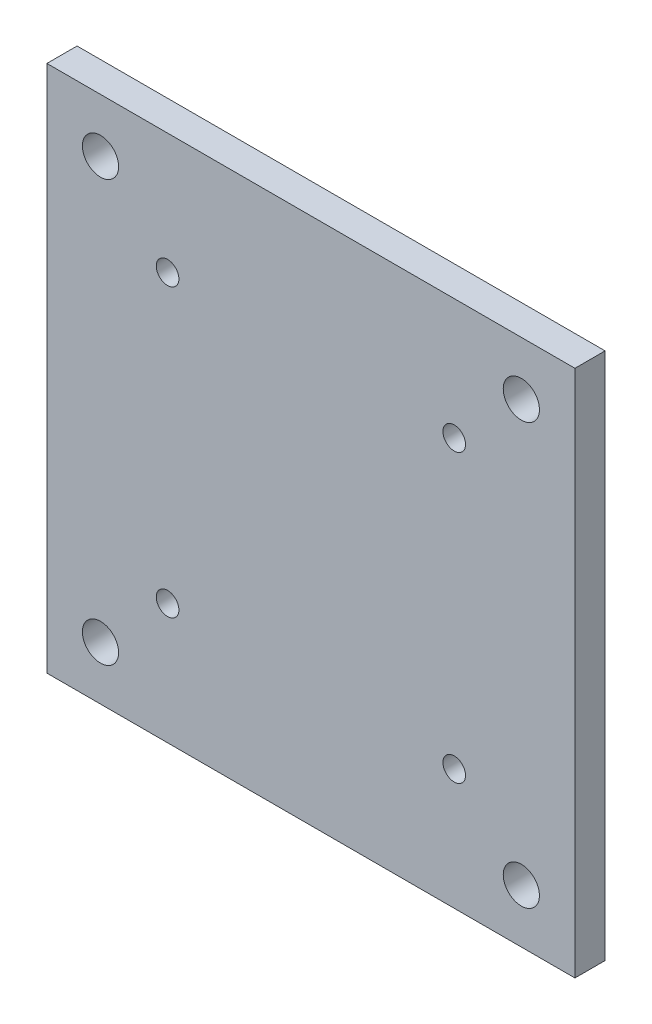
ISO-10303-21;
HEADER;
FILE_DESCRIPTION(('STEP AP214'),'2;1');
FILE_NAME('part.step','',(''),(''),'','','');
FILE_SCHEMA(('AUTOMOTIVE_DESIGN { 1 0 10303 214 1 1 1 1 }'));
ENDSEC;
DATA;
#1=APPLICATION_CONTEXT('core data for automotive mechanical design processes');
#2=APPLICATION_PROTOCOL_DEFINITION('international standard','automotive_design',2000,#1);
#3=PRODUCT_CONTEXT('',#1,'mechanical');
#4=PRODUCT('Part','Part','',(#3));
#5=PRODUCT_RELATED_PRODUCT_CATEGORY('part','',(#4));
#6=PRODUCT_DEFINITION_FORMATION('','',#4);
#7=PRODUCT_DEFINITION_CONTEXT('part definition',#1,'design');
#8=PRODUCT_DEFINITION('design','',#6,#7);
#9=PRODUCT_DEFINITION_SHAPE('','',#8);
#10=(LENGTH_UNIT() NAMED_UNIT(*) SI_UNIT(.MILLI.,.METRE.));
#11=(NAMED_UNIT(*) PLANE_ANGLE_UNIT() SI_UNIT($,.RADIAN.));
#12=(NAMED_UNIT(*) SI_UNIT($,.STERADIAN.) SOLID_ANGLE_UNIT());
#13=UNCERTAINTY_MEASURE_WITH_UNIT(LENGTH_MEASURE(1.E-05),#10,'distance_accuracy_value','');
#14=(GEOMETRIC_REPRESENTATION_CONTEXT(3) GLOBAL_UNCERTAINTY_ASSIGNED_CONTEXT((#13)) GLOBAL_UNIT_ASSIGNED_CONTEXT((#10,
#11,#12)) REPRESENTATION_CONTEXT('',''));
#15=CARTESIAN_POINT('',(0.,0.,0.));
#16=DIRECTION('',(0.,0.,1.));
#17=DIRECTION('',(1.,0.,0.));
#18=AXIS2_PLACEMENT_3D('',#15,#16,#17);
#19=CARTESIAN_POINT('',(0.,0.,4.));
#20=DIRECTION('',(0.,0.,-1.));
#21=DIRECTION('',(-1.,0.,0.));
#22=AXIS2_PLACEMENT_3D('',#19,#20,#21);
#23=PLANE('',#22);
#24=CARTESIAN_POINT('',(27.895,7.105,4.));
#25=DIRECTION('',(0.,0.,-1.));
#26=DIRECTION('',(-1.,0.,0.));
#27=AXIS2_PLACEMENT_3D('',#24,#25,#26);
#28=CIRCLE('',#27,2.40000000000001);
#29=CARTESIAN_POINT('',(25.495,7.105,4.));
#30=VERTEX_POINT('',#29);
#31=EDGE_CURVE('E268',#30,#30,#28,.T.);
#32=ORIENTED_EDGE('',*,*,#31,.T.);
#33=EDGE_LOOP('',(#32));
#34=FACE_BOUND('',#33,.T.);
#35=CARTESIAN_POINT('',(19.,16.,4.));
#36=DIRECTION('',(0.,0.,-1.));
#37=DIRECTION('',(-1.,0.,0.));
#38=AXIS2_PLACEMENT_3D('',#35,#36,#37);
#39=CIRCLE('',#38,1.5);
#40=CARTESIAN_POINT('',(17.5,16.,4.));
#41=VERTEX_POINT('',#40);
#42=EDGE_CURVE('E262',#41,#41,#39,.T.);
#43=ORIENTED_EDGE('',*,*,#42,.T.);
#44=EDGE_LOOP('',(#43));
#45=FACE_BOUND('',#44,.T.);
#46=CARTESIAN_POINT('',(27.895,62.895,4.));
#47=DIRECTION('',(0.,0.,-1.));
#48=DIRECTION('',(-1.,0.,0.));
#49=AXIS2_PLACEMENT_3D('',#46,#47,#48);
#50=CIRCLE('',#49,2.4);
#51=CARTESIAN_POINT('',(25.495,62.895,4.));
#52=VERTEX_POINT('',#51);
#53=EDGE_CURVE('E256',#52,#52,#50,.T.);
#54=ORIENTED_EDGE('',*,*,#53,.T.);
#55=EDGE_LOOP('',(#54));
#56=FACE_BOUND('',#55,.T.);
#57=CARTESIAN_POINT('',(19.,54.,4.));
#58=DIRECTION('',(0.,0.,-1.));
#59=DIRECTION('',(-1.,0.,0.));
#60=AXIS2_PLACEMENT_3D('',#57,#58,#59);
#61=CIRCLE('',#60,1.5);
#62=CARTESIAN_POINT('',(17.5,54.,4.));
#63=VERTEX_POINT('',#62);
#64=EDGE_CURVE('E250',#63,#63,#61,.T.);
#65=ORIENTED_EDGE('',*,*,#64,.T.);
#66=EDGE_LOOP('',(#65));
#67=FACE_BOUND('',#66,.T.);
#68=DIRECTION('',(0.,-1.,0.));
#69=VECTOR('',#68,1.);
#70=CARTESIAN_POINT('',(-35.,70.,4.));
#71=LINE('',#70,#69);
#72=CARTESIAN_POINT('',(-35.,70.,4.));
#73=VERTEX_POINT('',#72);
#74=CARTESIAN_POINT('',(-35.,0.,4.));
#75=VERTEX_POINT('',#74);
#76=EDGE_CURVE('E194',#73,#75,#71,.T.);
#77=ORIENTED_EDGE('',*,*,#76,.T.);
#78=DIRECTION('',(-1.,0.,0.));
#79=VECTOR('',#78,1.);
#80=CARTESIAN_POINT('',(35.,0.,4.));
#81=LINE('',#80,#79);
#82=CARTESIAN_POINT('',(35.,0.,4.));
#83=VERTEX_POINT('',#82);
#84=EDGE_CURVE('E201',#83,#75,#81,.T.);
#85=ORIENTED_EDGE('',*,*,#84,.F.);
#86=DIRECTION('',(0.,-1.,0.));
#87=VECTOR('',#86,1.);
#88=CARTESIAN_POINT('',(35.,70.,4.));
#89=LINE('',#88,#87);
#90=CARTESIAN_POINT('',(35.,70.,4.));
#91=VERTEX_POINT('',#90);
#92=EDGE_CURVE('E209',#91,#83,#89,.T.);
#93=ORIENTED_EDGE('',*,*,#92,.F.);
#94=DIRECTION('',(1.,0.,0.));
#95=VECTOR('',#94,1.);
#96=CARTESIAN_POINT('',(-35.,70.,4.));
#97=LINE('',#96,#95);
#98=EDGE_CURVE('E212',#73,#91,#97,.T.);
#99=ORIENTED_EDGE('',*,*,#98,.F.);
#100=EDGE_LOOP('',(#77,#85,#93,#99));
#101=FACE_BOUND('',#100,.T.);
#102=CARTESIAN_POINT('',(-27.895,62.895,4.));
#103=DIRECTION('',(0.,0.,1.));
#104=DIRECTION('',(1.,0.,0.));
#105=AXIS2_PLACEMENT_3D('',#102,#103,#104);
#106=CIRCLE('',#105,2.4);
#107=CARTESIAN_POINT('',(-25.495,62.895,4.));
#108=VERTEX_POINT('',#107);
#109=EDGE_CURVE('E219',#108,#108,#106,.T.);
#110=ORIENTED_EDGE('',*,*,#109,.F.);
#111=EDGE_LOOP('',(#110));
#112=FACE_BOUND('',#111,.T.);
#113=CARTESIAN_POINT('',(-27.895,7.105,4.));
#114=DIRECTION('',(0.,0.,1.));
#115=DIRECTION('',(1.,0.,0.));
#116=AXIS2_PLACEMENT_3D('',#113,#114,#115);
#117=CIRCLE('',#116,2.4);
#118=CARTESIAN_POINT('',(-25.495,7.105,4.));
#119=VERTEX_POINT('',#118);
#120=EDGE_CURVE('E232',#119,#119,#117,.T.);
#121=ORIENTED_EDGE('',*,*,#120,.F.);
#122=EDGE_LOOP('',(#121));
#123=FACE_BOUND('',#122,.T.);
#124=CARTESIAN_POINT('',(-19.,16.,4.));
#125=DIRECTION('',(0.,0.,1.));
#126=DIRECTION('',(1.,0.,0.));
#127=AXIS2_PLACEMENT_3D('',#124,#125,#126);
#128=CIRCLE('',#127,1.5);
#129=CARTESIAN_POINT('',(-17.5,16.,4.));
#130=VERTEX_POINT('',#129);
#131=EDGE_CURVE('E238',#130,#130,#128,.T.);
#132=ORIENTED_EDGE('',*,*,#131,.F.);
#133=EDGE_LOOP('',(#132));
#134=FACE_BOUND('',#133,.T.);
#135=CARTESIAN_POINT('',(-19.,54.,4.));
#136=DIRECTION('',(0.,0.,1.));
#137=DIRECTION('',(1.,0.,0.));
#138=AXIS2_PLACEMENT_3D('',#135,#136,#137);
#139=CIRCLE('',#138,1.5);
#140=CARTESIAN_POINT('',(-17.5,54.,4.));
#141=VERTEX_POINT('',#140);
#142=EDGE_CURVE('E244',#141,#141,#139,.T.);
#143=ORIENTED_EDGE('',*,*,#142,.F.);
#144=EDGE_LOOP('',(#143));
#145=FACE_BOUND('',#144,.T.);
#146=ADVANCED_FACE('F153',(#34,#45,#56,#67,#101,#112,#123,#134,#145),#23,.F.);
#147=CARTESIAN_POINT('',(0.,0.,0.));
#148=DIRECTION('',(0.,0.,-1.));
#149=DIRECTION('',(-1.,0.,0.));
#150=AXIS2_PLACEMENT_3D('',#147,#148,#149);
#151=PLANE('',#150);
#152=CARTESIAN_POINT('',(27.895,7.105,0.));
#153=DIRECTION('',(0.,0.,-1.));
#154=DIRECTION('',(-1.,0.,0.));
#155=AXIS2_PLACEMENT_3D('',#152,#153,#154);
#156=CIRCLE('',#155,2.40000000000001);
#157=CARTESIAN_POINT('',(25.495,7.105,0.));
#158=VERTEX_POINT('',#157);
#159=EDGE_CURVE('E271',#158,#158,#156,.T.);
#160=ORIENTED_EDGE('',*,*,#159,.F.);
#161=EDGE_LOOP('',(#160));
#162=FACE_BOUND('',#161,.T.);
#163=CARTESIAN_POINT('',(19.,16.,0.));
#164=DIRECTION('',(0.,0.,-1.));
#165=DIRECTION('',(-1.,0.,0.));
#166=AXIS2_PLACEMENT_3D('',#163,#164,#165);
#167=CIRCLE('',#166,1.5);
#168=CARTESIAN_POINT('',(17.5,16.,0.));
#169=VERTEX_POINT('',#168);
#170=EDGE_CURVE('E265',#169,#169,#167,.T.);
#171=ORIENTED_EDGE('',*,*,#170,.F.);
#172=EDGE_LOOP('',(#171));
#173=FACE_BOUND('',#172,.T.);
#174=CARTESIAN_POINT('',(27.895,62.895,0.));
#175=DIRECTION('',(0.,0.,-1.));
#176=DIRECTION('',(-1.,0.,0.));
#177=AXIS2_PLACEMENT_3D('',#174,#175,#176);
#178=CIRCLE('',#177,2.4);
#179=CARTESIAN_POINT('',(25.495,62.895,0.));
#180=VERTEX_POINT('',#179);
#181=EDGE_CURVE('E259',#180,#180,#178,.T.);
#182=ORIENTED_EDGE('',*,*,#181,.F.);
#183=EDGE_LOOP('',(#182));
#184=FACE_BOUND('',#183,.T.);
#185=CARTESIAN_POINT('',(19.,54.,0.));
#186=DIRECTION('',(0.,0.,-1.));
#187=DIRECTION('',(-1.,0.,0.));
#188=AXIS2_PLACEMENT_3D('',#185,#186,#187);
#189=CIRCLE('',#188,1.5);
#190=CARTESIAN_POINT('',(17.5,54.,0.));
#191=VERTEX_POINT('',#190);
#192=EDGE_CURVE('E253',#191,#191,#189,.T.);
#193=ORIENTED_EDGE('',*,*,#192,.F.);
#194=EDGE_LOOP('',(#193));
#195=FACE_BOUND('',#194,.T.);
#196=CARTESIAN_POINT('',(-19.,16.,0.));
#197=DIRECTION('',(0.,0.,1.));
#198=DIRECTION('',(1.,0.,0.));
#199=AXIS2_PLACEMENT_3D('',#196,#197,#198);
#200=CIRCLE('',#199,1.5);
#201=CARTESIAN_POINT('',(-17.5,16.,0.));
#202=VERTEX_POINT('',#201);
#203=EDGE_CURVE('E241',#202,#202,#200,.T.);
#204=ORIENTED_EDGE('',*,*,#203,.T.);
#205=EDGE_LOOP('',(#204));
#206=FACE_BOUND('',#205,.T.);
#207=CARTESIAN_POINT('',(-27.895,62.895,0.));
#208=DIRECTION('',(0.,0.,1.));
#209=DIRECTION('',(1.,0.,0.));
#210=AXIS2_PLACEMENT_3D('',#207,#208,#209);
#211=CIRCLE('',#210,2.4);
#212=CARTESIAN_POINT('',(-25.495,62.895,0.));
#213=VERTEX_POINT('',#212);
#214=EDGE_CURVE('E229',#213,#213,#211,.T.);
#215=ORIENTED_EDGE('',*,*,#214,.T.);
#216=EDGE_LOOP('',(#215));
#217=FACE_BOUND('',#216,.T.);
#218=DIRECTION('',(0.,-1.,0.));
#219=VECTOR('',#218,1.);
#220=CARTESIAN_POINT('',(-35.,70.,0.));
#221=LINE('',#220,#219);
#222=CARTESIAN_POINT('',(-35.,70.,0.));
#223=VERTEX_POINT('',#222);
#224=CARTESIAN_POINT('',(-35.,0.,0.));
#225=VERTEX_POINT('',#224);
#226=EDGE_CURVE('E217',#223,#225,#221,.T.);
#227=ORIENTED_EDGE('',*,*,#226,.F.);
#228=DIRECTION('',(1.,0.,0.));
#229=VECTOR('',#228,1.);
#230=CARTESIAN_POINT('',(-35.,70.,0.));
#231=LINE('',#230,#229);
#232=CARTESIAN_POINT('',(35.,70.,0.));
#233=VERTEX_POINT('',#232);
#234=EDGE_CURVE('E223',#223,#233,#231,.T.);
#235=ORIENTED_EDGE('',*,*,#234,.T.);
#236=DIRECTION('',(0.,-1.,0.));
#237=VECTOR('',#236,1.);
#238=CARTESIAN_POINT('',(35.,70.,0.));
#239=LINE('',#238,#237);
#240=CARTESIAN_POINT('',(35.,0.,0.));
#241=VERTEX_POINT('',#240);
#242=EDGE_CURVE('E221',#233,#241,#239,.T.);
#243=ORIENTED_EDGE('',*,*,#242,.T.);
#244=DIRECTION('',(-1.,0.,0.));
#245=VECTOR('',#244,1.);
#246=CARTESIAN_POINT('',(35.,0.,0.));
#247=LINE('',#246,#245);
#248=EDGE_CURVE('E203',#241,#225,#247,.T.);
#249=ORIENTED_EDGE('',*,*,#248,.T.);
#250=EDGE_LOOP('',(#227,#235,#243,#249));
#251=FACE_BOUND('',#250,.T.);
#252=CARTESIAN_POINT('',(-27.895,7.105,0.));
#253=DIRECTION('',(0.,0.,1.));
#254=DIRECTION('',(1.,0.,0.));
#255=AXIS2_PLACEMENT_3D('',#252,#253,#254);
#256=CIRCLE('',#255,2.4);
#257=CARTESIAN_POINT('',(-25.495,7.105,0.));
#258=VERTEX_POINT('',#257);
#259=EDGE_CURVE('E235',#258,#258,#256,.T.);
#260=ORIENTED_EDGE('',*,*,#259,.T.);
#261=EDGE_LOOP('',(#260));
#262=FACE_BOUND('',#261,.T.);
#263=CARTESIAN_POINT('',(-19.,54.,0.));
#264=DIRECTION('',(0.,0.,1.));
#265=DIRECTION('',(1.,0.,0.));
#266=AXIS2_PLACEMENT_3D('',#263,#264,#265);
#267=CIRCLE('',#266,1.5);
#268=CARTESIAN_POINT('',(-17.5,54.,0.));
#269=VERTEX_POINT('',#268);
#270=EDGE_CURVE('E247',#269,#269,#267,.T.);
#271=ORIENTED_EDGE('',*,*,#270,.T.);
#272=EDGE_LOOP('',(#271));
#273=FACE_BOUND('',#272,.T.);
#274=ADVANCED_FACE('F286',(#162,#173,#184,#195,#206,#217,#251,#262,#273),#151,.T.);
#275=CARTESIAN_POINT('',(-35.,70.,4.));
#276=DIRECTION('',(1.,0.,0.));
#277=DIRECTION('',(0.,0.,-1.));
#278=AXIS2_PLACEMENT_3D('',#275,#276,#277);
#279=PLANE('',#278);
#280=ORIENTED_EDGE('',*,*,#226,.T.);
#281=DIRECTION('',(0.,0.,-1.));
#282=VECTOR('',#281,1.);
#283=CARTESIAN_POINT('',(-35.,0.,4.));
#284=LINE('',#283,#282);
#285=EDGE_CURVE('E12',#75,#225,#284,.T.);
#286=ORIENTED_EDGE('',*,*,#285,.F.);
#287=ORIENTED_EDGE('',*,*,#76,.F.);
#288=DIRECTION('',(0.,0.,-1.));
#289=VECTOR('',#288,1.);
#290=CARTESIAN_POINT('',(-35.,70.,4.));
#291=LINE('',#290,#289);
#292=EDGE_CURVE('E170',#73,#223,#291,.T.);
#293=ORIENTED_EDGE('',*,*,#292,.T.);
#294=EDGE_LOOP('',(#280,#286,#287,#293));
#295=FACE_BOUND('',#294,.T.);
#296=ADVANCED_FACE('F155',(#295),#279,.F.);
#297=CARTESIAN_POINT('',(35.,0.,4.));
#298=DIRECTION('',(0.,-1.,0.));
#299=DIRECTION('',(1.,0.,0.));
#300=AXIS2_PLACEMENT_3D('',#297,#298,#299);
#301=PLANE('',#300);
#302=ORIENTED_EDGE('',*,*,#248,.F.);
#303=DIRECTION('',(0.,0.,-1.));
#304=VECTOR('',#303,1.);
#305=CARTESIAN_POINT('',(35.,0.,4.));
#306=LINE('',#305,#304);
#307=EDGE_CURVE('E162',#83,#241,#306,.T.);
#308=ORIENTED_EDGE('',*,*,#307,.F.);
#309=ORIENTED_EDGE('',*,*,#84,.T.);
#310=ORIENTED_EDGE('',*,*,#285,.T.);
#311=EDGE_LOOP('',(#302,#308,#309,#310));
#312=FACE_BOUND('',#311,.T.);
#313=ADVANCED_FACE('F200',(#312),#301,.T.);
#314=CARTESIAN_POINT('',(35.,70.,4.));
#315=DIRECTION('',(1.,0.,0.));
#316=DIRECTION('',(0.,0.,-1.));
#317=AXIS2_PLACEMENT_3D('',#314,#315,#316);
#318=PLANE('',#317);
#319=ORIENTED_EDGE('',*,*,#242,.F.);
#320=DIRECTION('',(0.,0.,-1.));
#321=VECTOR('',#320,1.);
#322=CARTESIAN_POINT('',(35.,70.,4.));
#323=LINE('',#322,#321);
#324=EDGE_CURVE('E183',#91,#233,#323,.T.);
#325=ORIENTED_EDGE('',*,*,#324,.F.);
#326=ORIENTED_EDGE('',*,*,#92,.T.);
#327=ORIENTED_EDGE('',*,*,#307,.T.);
#328=EDGE_LOOP('',(#319,#325,#326,#327));
#329=FACE_BOUND('',#328,.T.);
#330=ADVANCED_FACE('F211',(#329),#318,.T.);
#331=CARTESIAN_POINT('',(-35.,70.,4.));
#332=DIRECTION('',(0.,1.,0.));
#333=DIRECTION('',(0.,0.,1.));
#334=AXIS2_PLACEMENT_3D('',#331,#332,#333);
#335=PLANE('',#334);
#336=ORIENTED_EDGE('',*,*,#234,.F.);
#337=ORIENTED_EDGE('',*,*,#292,.F.);
#338=ORIENTED_EDGE('',*,*,#98,.T.);
#339=ORIENTED_EDGE('',*,*,#324,.T.);
#340=EDGE_LOOP('',(#336,#337,#338,#339));
#341=FACE_BOUND('',#340,.T.);
#342=ADVANCED_FACE('F328',(#341),#335,.T.);
#343=CARTESIAN_POINT('',(-27.895,62.895,4.));
#344=DIRECTION('',(0.,0.,-1.));
#345=DIRECTION('',(-1.,0.,0.));
#346=AXIS2_PLACEMENT_3D('',#343,#344,#345);
#347=CYLINDRICAL_SURFACE('',#346,2.4);
#348=ORIENTED_EDGE('',*,*,#109,.T.);
#349=EDGE_LOOP('',(#348));
#350=FACE_BOUND('',#349,.T.);
#351=ORIENTED_EDGE('',*,*,#214,.F.);
#352=EDGE_LOOP('',(#351));
#353=FACE_BOUND('',#352,.T.);
#354=ADVANCED_FACE('F325',(#350,#353),#347,.F.);
#355=CARTESIAN_POINT('',(-27.895,7.105,4.));
#356=DIRECTION('',(0.,0.,-1.));
#357=DIRECTION('',(-1.,0.,0.));
#358=AXIS2_PLACEMENT_3D('',#355,#356,#357);
#359=CYLINDRICAL_SURFACE('',#358,2.4);
#360=ORIENTED_EDGE('',*,*,#120,.T.);
#361=EDGE_LOOP('',(#360));
#362=FACE_BOUND('',#361,.T.);
#363=ORIENTED_EDGE('',*,*,#259,.F.);
#364=EDGE_LOOP('',(#363));
#365=FACE_BOUND('',#364,.T.);
#366=ADVANCED_FACE('F317',(#362,#365),#359,.F.);
#367=CARTESIAN_POINT('',(-19.,16.,4.));
#368=DIRECTION('',(0.,0.,-1.));
#369=DIRECTION('',(-1.,0.,0.));
#370=AXIS2_PLACEMENT_3D('',#367,#368,#369);
#371=CYLINDRICAL_SURFACE('',#370,1.5);
#372=ORIENTED_EDGE('',*,*,#131,.T.);
#373=EDGE_LOOP('',(#372));
#374=FACE_BOUND('',#373,.T.);
#375=ORIENTED_EDGE('',*,*,#203,.F.);
#376=EDGE_LOOP('',(#375));
#377=FACE_BOUND('',#376,.T.);
#378=ADVANCED_FACE('F307',(#374,#377),#371,.F.);
#379=CARTESIAN_POINT('',(-19.,54.,4.));
#380=DIRECTION('',(0.,0.,-1.));
#381=DIRECTION('',(-1.,0.,0.));
#382=AXIS2_PLACEMENT_3D('',#379,#380,#381);
#383=CYLINDRICAL_SURFACE('',#382,1.5);
#384=ORIENTED_EDGE('',*,*,#142,.T.);
#385=EDGE_LOOP('',(#384));
#386=FACE_BOUND('',#385,.T.);
#387=ORIENTED_EDGE('',*,*,#270,.F.);
#388=EDGE_LOOP('',(#387));
#389=FACE_BOUND('',#388,.T.);
#390=ADVANCED_FACE('F304',(#386,#389),#383,.F.);
#391=CARTESIAN_POINT('',(19.,54.,4.));
#392=DIRECTION('',(0.,0.,-1.));
#393=DIRECTION('',(-1.,0.,0.));
#394=AXIS2_PLACEMENT_3D('',#391,#392,#393);
#395=CYLINDRICAL_SURFACE('',#394,1.5);
#396=ORIENTED_EDGE('',*,*,#64,.F.);
#397=EDGE_LOOP('',(#396));
#398=FACE_BOUND('',#397,.T.);
#399=ORIENTED_EDGE('',*,*,#192,.T.);
#400=EDGE_LOOP('',(#399));
#401=FACE_BOUND('',#400,.T.);
#402=ADVANCED_FACE('F306',(#398,#401),#395,.F.);
#403=CARTESIAN_POINT('',(27.895,62.895,4.));
#404=DIRECTION('',(0.,0.,-1.));
#405=DIRECTION('',(-1.,0.,0.));
#406=AXIS2_PLACEMENT_3D('',#403,#404,#405);
#407=CYLINDRICAL_SURFACE('',#406,2.4);
#408=ORIENTED_EDGE('',*,*,#53,.F.);
#409=EDGE_LOOP('',(#408));
#410=FACE_BOUND('',#409,.T.);
#411=ORIENTED_EDGE('',*,*,#181,.T.);
#412=EDGE_LOOP('',(#411));
#413=FACE_BOUND('',#412,.T.);
#414=ADVANCED_FACE('F314',(#410,#413),#407,.F.);
#415=CARTESIAN_POINT('',(19.,16.,4.));
#416=DIRECTION('',(0.,0.,-1.));
#417=DIRECTION('',(-1.,0.,0.));
#418=AXIS2_PLACEMENT_3D('',#415,#416,#417);
#419=CYLINDRICAL_SURFACE('',#418,1.5);
#420=ORIENTED_EDGE('',*,*,#42,.F.);
#421=EDGE_LOOP('',(#420));
#422=FACE_BOUND('',#421,.T.);
#423=ORIENTED_EDGE('',*,*,#170,.T.);
#424=EDGE_LOOP('',(#423));
#425=FACE_BOUND('',#424,.T.);
#426=ADVANCED_FACE('F282',(#422,#425),#419,.F.);
#427=CARTESIAN_POINT('',(27.895,7.105,4.));
#428=DIRECTION('',(0.,0.,-1.));
#429=DIRECTION('',(-1.,0.,0.));
#430=AXIS2_PLACEMENT_3D('',#427,#428,#429);
#431=CYLINDRICAL_SURFACE('',#430,2.40000000000001);
#432=ORIENTED_EDGE('',*,*,#31,.F.);
#433=EDGE_LOOP('',(#432));
#434=FACE_BOUND('',#433,.T.);
#435=ORIENTED_EDGE('',*,*,#159,.T.);
#436=EDGE_LOOP('',(#435));
#437=FACE_BOUND('',#436,.T.);
#438=ADVANCED_FACE('F279',(#434,#437),#431,.F.);
#439=CLOSED_SHELL('',(#146,#274,#296,#313,#330,#342,#354,#366,#378,#390,#402,#414,#426,#438));
#440=MANIFOLD_SOLID_BREP('B2',#439);
#441=ADVANCED_BREP_SHAPE_REPRESENTATION('',(#18,#440),#14);
#442=SHAPE_DEFINITION_REPRESENTATION(#9,#441);
ENDSEC;
END-ISO-10303-21;
